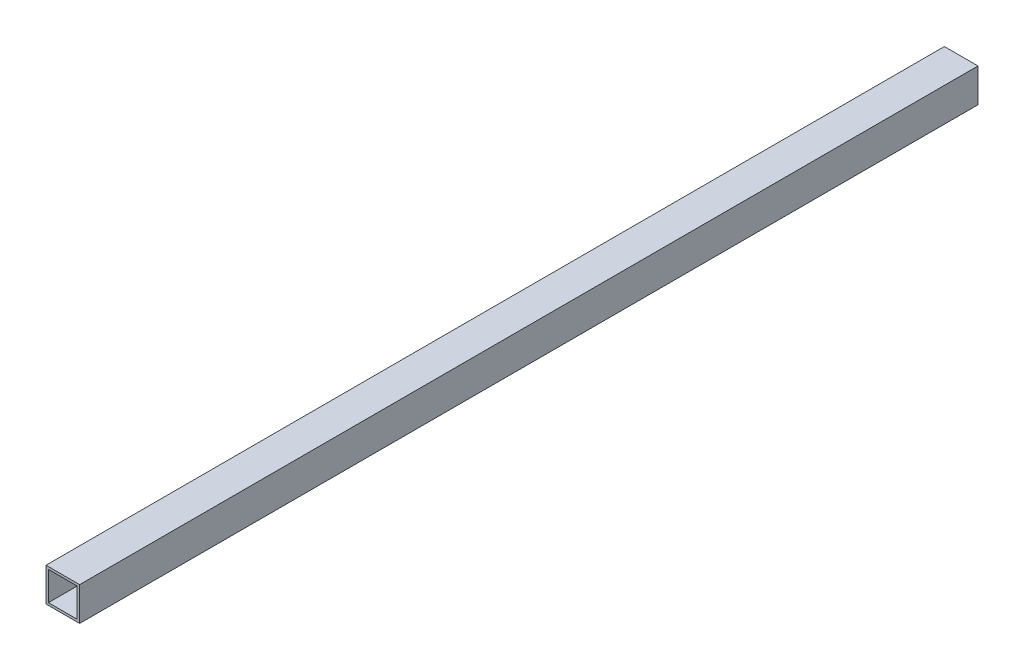
ISO-10303-21;
HEADER;
FILE_DESCRIPTION(('STEP AP214'),'2;1');
FILE_NAME('part.step','',(''),(''),'','','');
FILE_SCHEMA(('AUTOMOTIVE_DESIGN { 1 0 10303 214 1 1 1 1 }'));
ENDSEC;
DATA;
#1=APPLICATION_CONTEXT('core data for automotive mechanical design processes');
#2=APPLICATION_PROTOCOL_DEFINITION('international standard','automotive_design',2000,#1);
#3=PRODUCT_CONTEXT('',#1,'mechanical');
#4=PRODUCT('Part','Part','',(#3));
#5=PRODUCT_RELATED_PRODUCT_CATEGORY('part','',(#4));
#6=PRODUCT_DEFINITION_FORMATION('','',#4);
#7=PRODUCT_DEFINITION_CONTEXT('part definition',#1,'design');
#8=PRODUCT_DEFINITION('design','',#6,#7);
#9=PRODUCT_DEFINITION_SHAPE('','',#8);
#10=(LENGTH_UNIT() NAMED_UNIT(*) SI_UNIT(.MILLI.,.METRE.));
#11=(NAMED_UNIT(*) PLANE_ANGLE_UNIT() SI_UNIT($,.RADIAN.));
#12=(NAMED_UNIT(*) SI_UNIT($,.STERADIAN.) SOLID_ANGLE_UNIT());
#13=UNCERTAINTY_MEASURE_WITH_UNIT(LENGTH_MEASURE(1.E-05),#10,'distance_accuracy_value','');
#14=(GEOMETRIC_REPRESENTATION_CONTEXT(3) GLOBAL_UNCERTAINTY_ASSIGNED_CONTEXT((#13)) GLOBAL_UNIT_ASSIGNED_CONTEXT((#10,
#11,#12)) REPRESENTATION_CONTEXT('',''));
#15=CARTESIAN_POINT('',(0.,0.,0.));
#16=DIRECTION('',(0.,0.,1.));
#17=DIRECTION('',(1.,0.,0.));
#18=AXIS2_PLACEMENT_3D('',#15,#16,#17);
#19=CARTESIAN_POINT('',(0.,0.,1187.45));
#20=DIRECTION('',(0.,0.,-1.));
#21=DIRECTION('',(-1.,0.,0.));
#22=AXIS2_PLACEMENT_3D('',#19,#20,#21);
#23=PLANE('',#22);
#24=DIRECTION('',(0.,-1.,0.));
#25=VECTOR('',#24,1.);
#26=CARTESIAN_POINT('',(0.,0.,1187.45));
#27=LINE('',#26,#25);
#28=CARTESIAN_POINT('',(0.,44.45,1187.45));
#29=VERTEX_POINT('',#28);
#30=CARTESIAN_POINT('',(0.,0.,1187.45));
#31=VERTEX_POINT('',#30);
#32=EDGE_CURVE('E133',#29,#31,#27,.T.);
#33=ORIENTED_EDGE('',*,*,#32,.T.);
#34=DIRECTION('',(1.,0.,0.));
#35=VECTOR('',#34,1.);
#36=CARTESIAN_POINT('',(0.,0.,1187.45));
#37=LINE('',#36,#35);
#38=CARTESIAN_POINT('',(44.45,0.,1187.45));
#39=VERTEX_POINT('',#38);
#40=EDGE_CURVE('E136',#31,#39,#37,.T.);
#41=ORIENTED_EDGE('',*,*,#40,.T.);
#42=DIRECTION('',(0.,1.,0.));
#43=VECTOR('',#42,1.);
#44=CARTESIAN_POINT('',(44.45,0.,1187.45));
#45=LINE('',#44,#43);
#46=CARTESIAN_POINT('',(44.45,44.45,1187.45));
#47=VERTEX_POINT('',#46);
#48=EDGE_CURVE('E139',#39,#47,#45,.T.);
#49=ORIENTED_EDGE('',*,*,#48,.T.);
#50=DIRECTION('',(-1.,0.,0.));
#51=VECTOR('',#50,1.);
#52=CARTESIAN_POINT('',(0.,44.45,1187.45));
#53=LINE('',#52,#51);
#54=EDGE_CURVE('E141',#47,#29,#53,.T.);
#55=ORIENTED_EDGE('',*,*,#54,.T.);
#56=EDGE_LOOP('',(#33,#41,#49,#55));
#57=FACE_BOUND('',#56,.T.);
#58=DIRECTION('',(0.,-1.,0.));
#59=VECTOR('',#58,1.);
#60=CARTESIAN_POINT('',(3.175,3.17500000000004,1187.45));
#61=LINE('',#60,#59);
#62=CARTESIAN_POINT('',(3.175,41.2749999999999,1187.45));
#63=VERTEX_POINT('',#62);
#64=CARTESIAN_POINT('',(3.175,3.17500000000004,1187.45));
#65=VERTEX_POINT('',#64);
#66=EDGE_CURVE('E97',#63,#65,#61,.T.);
#67=ORIENTED_EDGE('',*,*,#66,.F.);
#68=DIRECTION('',(-1.,0.,0.));
#69=VECTOR('',#68,1.);
#70=CARTESIAN_POINT('',(3.175,41.2749999999999,1187.45));
#71=LINE('',#70,#69);
#72=CARTESIAN_POINT('',(41.275,41.2749999999999,1187.45));
#73=VERTEX_POINT('',#72);
#74=EDGE_CURVE('E119',#73,#63,#71,.T.);
#75=ORIENTED_EDGE('',*,*,#74,.F.);
#76=DIRECTION('',(0.,1.,0.));
#77=VECTOR('',#76,1.);
#78=CARTESIAN_POINT('',(41.275,3.17500000000004,1187.45));
#79=LINE('',#78,#77);
#80=CARTESIAN_POINT('',(41.275,3.17500000000004,1187.45));
#81=VERTEX_POINT('',#80);
#82=EDGE_CURVE('E117',#81,#73,#79,.T.);
#83=ORIENTED_EDGE('',*,*,#82,.F.);
#84=DIRECTION('',(1.,0.,0.));
#85=VECTOR('',#84,1.);
#86=CARTESIAN_POINT('',(3.175,3.17500000000004,1187.45));
#87=LINE('',#86,#85);
#88=EDGE_CURVE('E105',#65,#81,#87,.T.);
#89=ORIENTED_EDGE('',*,*,#88,.F.);
#90=EDGE_LOOP('',(#67,#75,#83,#89));
#91=FACE_BOUND('',#90,.T.);
#92=ADVANCED_FACE('F32',(#57,#91),#23,.F.);
#93=CARTESIAN_POINT('',(0.,0.,0.));
#94=DIRECTION('',(0.,0.,-1.));
#95=DIRECTION('',(-1.,0.,0.));
#96=AXIS2_PLACEMENT_3D('',#93,#94,#95);
#97=PLANE('',#96);
#98=DIRECTION('',(0.,-1.,0.));
#99=VECTOR('',#98,1.);
#100=CARTESIAN_POINT('',(0.,0.,0.));
#101=LINE('',#100,#99);
#102=CARTESIAN_POINT('',(0.,44.45,0.));
#103=VERTEX_POINT('',#102);
#104=CARTESIAN_POINT('',(0.,0.,0.));
#105=VERTEX_POINT('',#104);
#106=EDGE_CURVE('E113',#103,#105,#101,.T.);
#107=ORIENTED_EDGE('',*,*,#106,.F.);
#108=DIRECTION('',(-1.,0.,0.));
#109=VECTOR('',#108,1.);
#110=CARTESIAN_POINT('',(0.,44.45,0.));
#111=LINE('',#110,#109);
#112=CARTESIAN_POINT('',(44.45,44.45,0.));
#113=VERTEX_POINT('',#112);
#114=EDGE_CURVE('E137',#113,#103,#111,.T.);
#115=ORIENTED_EDGE('',*,*,#114,.F.);
#116=DIRECTION('',(0.,1.,0.));
#117=VECTOR('',#116,1.);
#118=CARTESIAN_POINT('',(44.45,0.,0.));
#119=LINE('',#118,#117);
#120=CARTESIAN_POINT('',(44.45,0.,0.));
#121=VERTEX_POINT('',#120);
#122=EDGE_CURVE('E148',#121,#113,#119,.T.);
#123=ORIENTED_EDGE('',*,*,#122,.F.);
#124=DIRECTION('',(1.,0.,0.));
#125=VECTOR('',#124,1.);
#126=CARTESIAN_POINT('',(0.,0.,0.));
#127=LINE('',#126,#125);
#128=EDGE_CURVE('E146',#105,#121,#127,.T.);
#129=ORIENTED_EDGE('',*,*,#128,.F.);
#130=EDGE_LOOP('',(#107,#115,#123,#129));
#131=FACE_BOUND('',#130,.T.);
#132=DIRECTION('',(-1.,0.,0.));
#133=VECTOR('',#132,1.);
#134=CARTESIAN_POINT('',(3.175,41.2749999999999,0.));
#135=LINE('',#134,#133);
#136=CARTESIAN_POINT('',(41.275,41.2749999999999,0.));
#137=VERTEX_POINT('',#136);
#138=CARTESIAN_POINT('',(3.175,41.2749999999999,0.));
#139=VERTEX_POINT('',#138);
#140=EDGE_CURVE('E106',#137,#139,#135,.T.);
#141=ORIENTED_EDGE('',*,*,#140,.T.);
#142=DIRECTION('',(0.,-1.,0.));
#143=VECTOR('',#142,1.);
#144=CARTESIAN_POINT('',(3.175,3.17500000000004,0.));
#145=LINE('',#144,#143);
#146=CARTESIAN_POINT('',(3.175,3.17500000000004,0.));
#147=VERTEX_POINT('',#146);
#148=EDGE_CURVE('E55',#139,#147,#145,.T.);
#149=ORIENTED_EDGE('',*,*,#148,.T.);
#150=DIRECTION('',(1.,0.,0.));
#151=VECTOR('',#150,1.);
#152=CARTESIAN_POINT('',(3.175,3.17500000000004,0.));
#153=LINE('',#152,#151);
#154=CARTESIAN_POINT('',(41.275,3.17500000000004,0.));
#155=VERTEX_POINT('',#154);
#156=EDGE_CURVE('E112',#147,#155,#153,.T.);
#157=ORIENTED_EDGE('',*,*,#156,.T.);
#158=DIRECTION('',(0.,1.,0.));
#159=VECTOR('',#158,1.);
#160=CARTESIAN_POINT('',(41.275,3.17500000000004,0.));
#161=LINE('',#160,#159);
#162=EDGE_CURVE('E125',#155,#137,#161,.T.);
#163=ORIENTED_EDGE('',*,*,#162,.T.);
#164=EDGE_LOOP('',(#141,#149,#157,#163));
#165=FACE_BOUND('',#164,.T.);
#166=ADVANCED_FACE('F166',(#131,#165),#97,.T.);
#167=CARTESIAN_POINT('',(0.,0.,1187.45));
#168=DIRECTION('',(1.,0.,0.));
#169=DIRECTION('',(0.,0.,-1.));
#170=AXIS2_PLACEMENT_3D('',#167,#168,#169);
#171=PLANE('',#170);
#172=ORIENTED_EDGE('',*,*,#106,.T.);
#173=DIRECTION('',(0.,0.,-1.));
#174=VECTOR('',#173,1.);
#175=CARTESIAN_POINT('',(0.,0.,1187.45));
#176=LINE('',#175,#174);
#177=EDGE_CURVE('E11',#31,#105,#176,.T.);
#178=ORIENTED_EDGE('',*,*,#177,.F.);
#179=ORIENTED_EDGE('',*,*,#32,.F.);
#180=DIRECTION('',(0.,0.,-1.));
#181=VECTOR('',#180,1.);
#182=CARTESIAN_POINT('',(0.,44.45,1187.45));
#183=LINE('',#182,#181);
#184=EDGE_CURVE('E143',#29,#103,#183,.T.);
#185=ORIENTED_EDGE('',*,*,#184,.T.);
#186=EDGE_LOOP('',(#172,#178,#179,#185));
#187=FACE_BOUND('',#186,.T.);
#188=ADVANCED_FACE('F34',(#187),#171,.F.);
#189=CARTESIAN_POINT('',(0.,0.,1187.45));
#190=DIRECTION('',(0.,1.,0.));
#191=DIRECTION('',(0.,0.,1.));
#192=AXIS2_PLACEMENT_3D('',#189,#190,#191);
#193=PLANE('',#192);
#194=ORIENTED_EDGE('',*,*,#128,.T.);
#195=DIRECTION('',(0.,0.,-1.));
#196=VECTOR('',#195,1.);
#197=CARTESIAN_POINT('',(44.45,0.,1187.45));
#198=LINE('',#197,#196);
#199=EDGE_CURVE('E40',#39,#121,#198,.T.);
#200=ORIENTED_EDGE('',*,*,#199,.F.);
#201=ORIENTED_EDGE('',*,*,#40,.F.);
#202=ORIENTED_EDGE('',*,*,#177,.T.);
#203=EDGE_LOOP('',(#194,#200,#201,#202));
#204=FACE_BOUND('',#203,.T.);
#205=ADVANCED_FACE('F176',(#204),#193,.F.);
#206=CARTESIAN_POINT('',(44.45,0.,1187.45));
#207=DIRECTION('',(-1.,0.,0.));
#208=DIRECTION('',(0.,0.,1.));
#209=AXIS2_PLACEMENT_3D('',#206,#207,#208);
#210=PLANE('',#209);
#211=ORIENTED_EDGE('',*,*,#122,.T.);
#212=DIRECTION('',(0.,0.,-1.));
#213=VECTOR('',#212,1.);
#214=CARTESIAN_POINT('',(44.45,44.45,1187.45));
#215=LINE('',#214,#213);
#216=EDGE_CURVE('E153',#47,#113,#215,.T.);
#217=ORIENTED_EDGE('',*,*,#216,.F.);
#218=ORIENTED_EDGE('',*,*,#48,.F.);
#219=ORIENTED_EDGE('',*,*,#199,.T.);
#220=EDGE_LOOP('',(#211,#217,#218,#219));
#221=FACE_BOUND('',#220,.T.);
#222=ADVANCED_FACE('F160',(#221),#210,.F.);
#223=CARTESIAN_POINT('',(0.,44.45,1187.45));
#224=DIRECTION('',(0.,-1.,0.));
#225=DIRECTION('',(0.,0.,-1.));
#226=AXIS2_PLACEMENT_3D('',#223,#224,#225);
#227=PLANE('',#226);
#228=ORIENTED_EDGE('',*,*,#114,.T.);
#229=ORIENTED_EDGE('',*,*,#184,.F.);
#230=ORIENTED_EDGE('',*,*,#54,.F.);
#231=ORIENTED_EDGE('',*,*,#216,.T.);
#232=EDGE_LOOP('',(#228,#229,#230,#231));
#233=FACE_BOUND('',#232,.T.);
#234=ADVANCED_FACE('F170',(#233),#227,.F.);
#235=CARTESIAN_POINT('',(3.175,3.17500000000004,1187.45));
#236=DIRECTION('',(1.,0.,0.));
#237=DIRECTION('',(0.,0.,-1.));
#238=AXIS2_PLACEMENT_3D('',#235,#236,#237);
#239=PLANE('',#238);
#240=ORIENTED_EDGE('',*,*,#148,.F.);
#241=DIRECTION('',(0.,0.,-1.));
#242=VECTOR('',#241,1.);
#243=CARTESIAN_POINT('',(3.175,41.2749999999999,1187.45));
#244=LINE('',#243,#242);
#245=EDGE_CURVE('E101',#63,#139,#244,.T.);
#246=ORIENTED_EDGE('',*,*,#245,.F.);
#247=ORIENTED_EDGE('',*,*,#66,.T.);
#248=DIRECTION('',(0.,0.,-1.));
#249=VECTOR('',#248,1.);
#250=CARTESIAN_POINT('',(3.175,3.17500000000004,1187.45));
#251=LINE('',#250,#249);
#252=EDGE_CURVE('E100',#65,#147,#251,.T.);
#253=ORIENTED_EDGE('',*,*,#252,.T.);
#254=EDGE_LOOP('',(#240,#246,#247,#253));
#255=FACE_BOUND('',#254,.T.);
#256=ADVANCED_FACE('F99',(#255),#239,.T.);
#257=CARTESIAN_POINT('',(3.175,3.17500000000004,1187.45));
#258=DIRECTION('',(0.,1.,0.));
#259=DIRECTION('',(0.,0.,1.));
#260=AXIS2_PLACEMENT_3D('',#257,#258,#259);
#261=PLANE('',#260);
#262=ORIENTED_EDGE('',*,*,#156,.F.);
#263=ORIENTED_EDGE('',*,*,#252,.F.);
#264=ORIENTED_EDGE('',*,*,#88,.T.);
#265=DIRECTION('',(0.,0.,-1.));
#266=VECTOR('',#265,1.);
#267=CARTESIAN_POINT('',(41.275,3.17500000000004,1187.45));
#268=LINE('',#267,#266);
#269=EDGE_CURVE('E114',#81,#155,#268,.T.);
#270=ORIENTED_EDGE('',*,*,#269,.T.);
#271=EDGE_LOOP('',(#262,#263,#264,#270));
#272=FACE_BOUND('',#271,.T.);
#273=ADVANCED_FACE('F109',(#272),#261,.T.);
#274=CARTESIAN_POINT('',(41.275,3.17500000000004,1187.45));
#275=DIRECTION('',(-1.,0.,0.));
#276=DIRECTION('',(0.,0.,1.));
#277=AXIS2_PLACEMENT_3D('',#274,#275,#276);
#278=PLANE('',#277);
#279=ORIENTED_EDGE('',*,*,#162,.F.);
#280=ORIENTED_EDGE('',*,*,#269,.F.);
#281=ORIENTED_EDGE('',*,*,#82,.T.);
#282=DIRECTION('',(0.,0.,-1.));
#283=VECTOR('',#282,1.);
#284=CARTESIAN_POINT('',(41.275,41.2749999999999,1187.45));
#285=LINE('',#284,#283);
#286=EDGE_CURVE('E47',#73,#137,#285,.T.);
#287=ORIENTED_EDGE('',*,*,#286,.T.);
#288=EDGE_LOOP('',(#279,#280,#281,#287));
#289=FACE_BOUND('',#288,.T.);
#290=ADVANCED_FACE('F199',(#289),#278,.T.);
#291=CARTESIAN_POINT('',(3.175,41.2749999999999,1187.45));
#292=DIRECTION('',(0.,-1.,0.));
#293=DIRECTION('',(0.,0.,-1.));
#294=AXIS2_PLACEMENT_3D('',#291,#292,#293);
#295=PLANE('',#294);
#296=ORIENTED_EDGE('',*,*,#140,.F.);
#297=ORIENTED_EDGE('',*,*,#286,.F.);
#298=ORIENTED_EDGE('',*,*,#74,.T.);
#299=ORIENTED_EDGE('',*,*,#245,.T.);
#300=EDGE_LOOP('',(#296,#297,#298,#299));
#301=FACE_BOUND('',#300,.T.);
#302=ADVANCED_FACE('F203',(#301),#295,.T.);
#303=CLOSED_SHELL('',(#92,#166,#188,#205,#222,#234,#256,#273,#290,#302));
#304=MANIFOLD_SOLID_BREP('B2',#303);
#305=ADVANCED_BREP_SHAPE_REPRESENTATION('',(#18,#304),#14);
#306=SHAPE_DEFINITION_REPRESENTATION(#9,#305);
ENDSEC;
END-ISO-10303-21;
